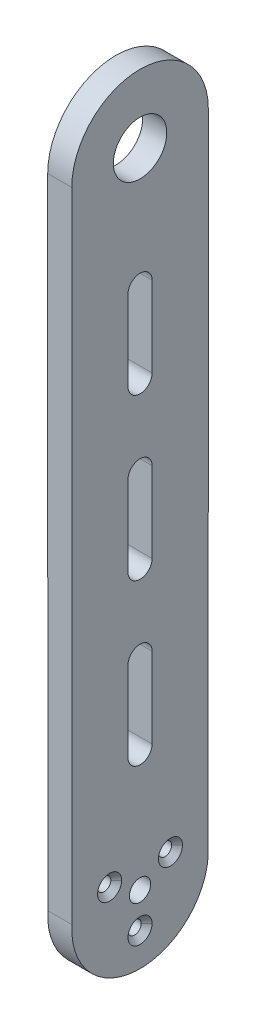
ISO-10303-21;
HEADER;
FILE_DESCRIPTION(('STEP AP214'),'2;1');
FILE_NAME('part.step','',(''),(''),'','','');
FILE_SCHEMA(('AUTOMOTIVE_DESIGN { 1 0 10303 214 1 1 1 1 }'));
ENDSEC;
DATA;
#1=APPLICATION_CONTEXT('core data for automotive mechanical design processes');
#2=APPLICATION_PROTOCOL_DEFINITION('international standard','automotive_design',2000,#1);
#3=PRODUCT_CONTEXT('',#1,'mechanical');
#4=PRODUCT('Part','Part','',(#3));
#5=PRODUCT_RELATED_PRODUCT_CATEGORY('part','',(#4));
#6=PRODUCT_DEFINITION_FORMATION('','',#4);
#7=PRODUCT_DEFINITION_CONTEXT('part definition',#1,'design');
#8=PRODUCT_DEFINITION('design','',#6,#7);
#9=PRODUCT_DEFINITION_SHAPE('','',#8);
#10=(LENGTH_UNIT() NAMED_UNIT(*) SI_UNIT(.MILLI.,.METRE.));
#11=(NAMED_UNIT(*) PLANE_ANGLE_UNIT() SI_UNIT($,.RADIAN.));
#12=(NAMED_UNIT(*) SI_UNIT($,.STERADIAN.) SOLID_ANGLE_UNIT());
#13=UNCERTAINTY_MEASURE_WITH_UNIT(LENGTH_MEASURE(1.E-05),#10,'distance_accuracy_value','');
#14=(GEOMETRIC_REPRESENTATION_CONTEXT(3) GLOBAL_UNCERTAINTY_ASSIGNED_CONTEXT((#13)) GLOBAL_UNIT_ASSIGNED_CONTEXT((#10,
#11,#12)) REPRESENTATION_CONTEXT('',''));
#15=CARTESIAN_POINT('',(0.,0.,0.));
#16=DIRECTION('',(0.,0.,1.));
#17=DIRECTION('',(1.,0.,0.));
#18=AXIS2_PLACEMENT_3D('',#15,#16,#17);
#19=CARTESIAN_POINT('',(-3.,0.,0.));
#20=DIRECTION('',(1.,0.,0.));
#21=DIRECTION('',(0.,0.,-1.));
#22=AXIS2_PLACEMENT_3D('',#19,#20,#21);
#23=CYLINDRICAL_SURFACE('',#22,17.);
#24=DIRECTION('',(1.,0.,0.));
#25=VECTOR('',#24,1.);
#26=CARTESIAN_POINT('',(-3.,0.999088073759542,16.9706164596597));
#27=LINE('',#26,#25);
#28=CARTESIAN_POINT('',(-3.,0.999088073759597,16.9706164596597));
#29=VERTEX_POINT('',#28);
#30=CARTESIAN_POINT('',(3.,0.999088073759543,16.9706164596597));
#31=VERTEX_POINT('',#30);
#32=EDGE_CURVE('E239',#29,#31,#27,.T.);
#33=ORIENTED_EDGE('',*,*,#32,.F.);
#34=CARTESIAN_POINT('',(-3.,0.,0.));
#35=DIRECTION('',(1.,0.,0.));
#36=DIRECTION('',(0.,0.561338641244818,0.827586206896552));
#37=AXIS2_PLACEMENT_3D('',#34,#35,#36);
#38=CIRCLE('',#37,17.);
#39=CARTESIAN_POINT('',(-3.,0.999088073759543,-16.9706164596597));
#40=VERTEX_POINT('',#39);
#41=EDGE_CURVE('E424',#29,#40,#38,.T.);
#42=ORIENTED_EDGE('',*,*,#41,.T.);
#43=DIRECTION('',(1.,0.,0.));
#44=VECTOR('',#43,1.);
#45=CARTESIAN_POINT('',(-3.,0.999088073759542,-16.9706164596597));
#46=LINE('',#45,#44);
#47=CARTESIAN_POINT('',(3.,0.999088073759543,-16.9706164596597));
#48=VERTEX_POINT('',#47);
#49=EDGE_CURVE('E68',#40,#48,#46,.T.);
#50=ORIENTED_EDGE('',*,*,#49,.T.);
#51=CARTESIAN_POINT('',(3.,0.,0.));
#52=DIRECTION('',(1.,0.,0.));
#53=DIRECTION('',(0.,0.561338641244818,0.827586206896552));
#54=AXIS2_PLACEMENT_3D('',#51,#52,#53);
#55=CIRCLE('',#54,17.);
#56=EDGE_CURVE('E72',#31,#48,#55,.T.);
#57=ORIENTED_EDGE('',*,*,#56,.F.);
#58=EDGE_LOOP('',(#33,#42,#50,#57));
#59=FACE_BOUND('',#58,.T.);
#60=ADVANCED_FACE('F52',(#59),#23,.T.);
#61=CARTESIAN_POINT('',(1.4159414336793,4.375,7.57772228311384));
#62=DIRECTION('',(1.,0.,0.));
#63=DIRECTION('',(0.,0.,-1.));
#64=AXIS2_PLACEMENT_3D('',#61,#62,#63);
#65=CONICAL_SURFACE('',#64,1.4159414336793,0.785398163397449);
#66=DIRECTION('',(-0.707106781186547,-4.31774598039509E-08,-0.707106781186546));
#67=VECTOR('',#66,1.);
#68=CARTESIAN_POINT('',(2.99999998662978,4.37500018318645,10.5777222697436));
#69=LINE('',#68,#67);
#70=CARTESIAN_POINT('',(2.99999999539441,4.37500005514268,10.5777222785082));
#71=VERTEX_POINT('',#70);
#72=CARTESIAN_POINT('',(1.65,4.37500010075255,9.22772228311382));
#73=VERTEX_POINT('',#72);
#74=EDGE_CURVE('E56',#71,#73,#69,.T.);
#75=ORIENTED_EDGE('',*,*,#74,.T.);
#76=CARTESIAN_POINT('',(1.65,4.375,7.57772228311384));
#77=DIRECTION('',(1.,0.,0.));
#78=DIRECTION('',(0.,0.,-1.));
#79=AXIS2_PLACEMENT_3D('',#76,#77,#78);
#80=CIRCLE('',#79,1.65);
#81=CARTESIAN_POINT('',(1.65,4.37499989924745,5.92772228311384));
#82=VERTEX_POINT('',#81);
#83=EDGE_CURVE('E408',#73,#82,#80,.F.);
#84=ORIENTED_EDGE('',*,*,#83,.T.);
#85=DIRECTION('',(-0.707106781186547,4.31774602128291E-08,0.707106781186546));
#86=VECTOR('',#85,1.);
#87=CARTESIAN_POINT('',(2.99999998662978,4.37499981681355,4.57772229648406));
#88=LINE('',#87,#86);
#89=CARTESIAN_POINT('',(2.99999999539441,4.37499994485732,4.57772228771943));
#90=VERTEX_POINT('',#89);
#91=EDGE_CURVE('E12',#90,#82,#88,.T.);
#92=ORIENTED_EDGE('',*,*,#91,.F.);
#93=CARTESIAN_POINT('',(3.,4.375,7.57772228311384));
#94=DIRECTION('',(-1.,0.,0.));
#95=DIRECTION('',(0.,0.,1.));
#96=AXIS2_PLACEMENT_3D('',#93,#94,#95);
#97=CIRCLE('',#96,3.);
#98=EDGE_CURVE('E449',#71,#90,#97,.T.);
#99=ORIENTED_EDGE('',*,*,#98,.F.);
#100=EDGE_LOOP('',(#75,#84,#92,#99));
#101=FACE_BOUND('',#100,.T.);
#102=ADVANCED_FACE('F54',(#101),#65,.F.);
#103=CARTESIAN_POINT('',(1.4159414336793,4.375,7.57772228311384));
#104=DIRECTION('',(1.,0.,0.));
#105=DIRECTION('',(0.,0.,-1.));
#106=AXIS2_PLACEMENT_3D('',#103,#104,#105);
#107=CONICAL_SURFACE('',#106,1.4159414336793,0.785398163397449);
#108=ORIENTED_EDGE('',*,*,#91,.T.);
#109=CARTESIAN_POINT('',(1.65,4.375,7.57772228311384));
#110=DIRECTION('',(1.,0.,0.));
#111=DIRECTION('',(0.,0.,-1.));
#112=AXIS2_PLACEMENT_3D('',#109,#110,#111);
#113=CIRCLE('',#112,1.65);
#114=EDGE_CURVE('E404',#82,#73,#113,.F.);
#115=ORIENTED_EDGE('',*,*,#114,.T.);
#116=ORIENTED_EDGE('',*,*,#74,.F.);
#117=CARTESIAN_POINT('',(3.,4.375,7.57772228311384));
#118=DIRECTION('',(-1.,0.,0.));
#119=DIRECTION('',(0.,0.,-1.));
#120=AXIS2_PLACEMENT_3D('',#117,#118,#119);
#121=CIRCLE('',#120,3.);
#122=EDGE_CURVE('E445',#90,#71,#121,.T.);
#123=ORIENTED_EDGE('',*,*,#122,.F.);
#124=EDGE_LOOP('',(#108,#115,#116,#123));
#125=FACE_BOUND('',#124,.T.);
#126=ADVANCED_FACE('F509',(#125),#107,.F.);
#127=CARTESIAN_POINT('',(1.4159414336793,4.375,-7.57772228311384));
#128=DIRECTION('',(1.,0.,0.));
#129=DIRECTION('',(0.,0.,-1.));
#130=AXIS2_PLACEMENT_3D('',#127,#128,#129);
#131=CONICAL_SURFACE('',#130,1.4159414336793,0.785398163397449);
#132=DIRECTION('',(-0.707106781186547,-4.31774606217073E-08,-0.707106781186546));
#133=VECTOR('',#132,1.);
#134=CARTESIAN_POINT('',(2.99999998662979,4.37500018318645,-4.57772229648406));
#135=LINE('',#134,#133);
#136=CARTESIAN_POINT('',(2.99999999539441,4.37500005514268,-4.57772228771943));
#137=VERTEX_POINT('',#136);
#138=CARTESIAN_POINT('',(1.65,4.37500010075255,-5.92772228311385));
#139=VERTEX_POINT('',#138);
#140=EDGE_CURVE('E458',#137,#139,#135,.T.);
#141=ORIENTED_EDGE('',*,*,#140,.T.);
#142=CARTESIAN_POINT('',(1.65,4.375,-7.57772228311384));
#143=DIRECTION('',(1.,0.,0.));
#144=DIRECTION('',(0.,0.,-1.));
#145=AXIS2_PLACEMENT_3D('',#142,#143,#144);
#146=CIRCLE('',#145,1.65);
#147=CARTESIAN_POINT('',(1.65,4.37499989924745,-9.22772228311382));
#148=VERTEX_POINT('',#147);
#149=EDGE_CURVE('E416',#139,#148,#146,.F.);
#150=ORIENTED_EDGE('',*,*,#149,.T.);
#151=DIRECTION('',(-0.707106781186548,4.31774598039509E-08,0.707106781186546));
#152=VECTOR('',#151,1.);
#153=CARTESIAN_POINT('',(2.99999998662978,4.37499981681355,-10.5777222697436));
#154=LINE('',#153,#152);
#155=CARTESIAN_POINT('',(2.99999999539441,4.37499994485732,-10.5777222785082));
#156=VERTEX_POINT('',#155);
#157=EDGE_CURVE('E462',#156,#148,#154,.T.);
#158=ORIENTED_EDGE('',*,*,#157,.F.);
#159=CARTESIAN_POINT('',(3.,4.375,-7.57772228311384));
#160=DIRECTION('',(-1.,0.,0.));
#161=DIRECTION('',(0.,0.,1.));
#162=AXIS2_PLACEMENT_3D('',#159,#160,#161);
#163=CIRCLE('',#162,3.);
#164=EDGE_CURVE('E441',#137,#156,#163,.T.);
#165=ORIENTED_EDGE('',*,*,#164,.F.);
#166=EDGE_LOOP('',(#141,#150,#158,#165));
#167=FACE_BOUND('',#166,.T.);
#168=ADVANCED_FACE('F470',(#167),#131,.F.);
#169=CARTESIAN_POINT('',(1.4159414336793,4.375,-7.57772228311384));
#170=DIRECTION('',(1.,0.,0.));
#171=DIRECTION('',(0.,0.,-1.));
#172=AXIS2_PLACEMENT_3D('',#169,#170,#171);
#173=CONICAL_SURFACE('',#172,1.4159414336793,0.785398163397449);
#174=ORIENTED_EDGE('',*,*,#157,.T.);
#175=CARTESIAN_POINT('',(1.65,4.375,-7.57772228311384));
#176=DIRECTION('',(1.,0.,0.));
#177=DIRECTION('',(0.,0.,-1.));
#178=AXIS2_PLACEMENT_3D('',#175,#176,#177);
#179=CIRCLE('',#178,1.65);
#180=EDGE_CURVE('E412',#148,#139,#179,.F.);
#181=ORIENTED_EDGE('',*,*,#180,.T.);
#182=ORIENTED_EDGE('',*,*,#140,.F.);
#183=CARTESIAN_POINT('',(3.,4.375,-7.57772228311384));
#184=DIRECTION('',(-1.,0.,0.));
#185=DIRECTION('',(0.,0.,-1.));
#186=AXIS2_PLACEMENT_3D('',#183,#184,#185);
#187=CIRCLE('',#186,3.);
#188=EDGE_CURVE('E437',#156,#137,#187,.T.);
#189=ORIENTED_EDGE('',*,*,#188,.F.);
#190=EDGE_LOOP('',(#174,#181,#182,#189));
#191=FACE_BOUND('',#190,.T.);
#192=ADVANCED_FACE('F473',(#191),#173,.F.);
#193=CARTESIAN_POINT('',(1.4159414336793,-8.75,0.));
#194=DIRECTION('',(1.,0.,0.));
#195=DIRECTION('',(0.,0.,-1.));
#196=AXIS2_PLACEMENT_3D('',#193,#194,#195);
#197=CONICAL_SURFACE('',#196,1.4159414336793,0.785398163397449);
#198=DIRECTION('',(-0.707106781186547,-4.31774610305856E-08,-0.707106781186546));
#199=VECTOR('',#198,1.);
#200=CARTESIAN_POINT('',(2.99999998662978,-8.74999981681355,2.99999998662978));
#201=LINE('',#200,#199);
#202=CARTESIAN_POINT('',(2.99999999539441,-8.74999994485732,2.99999999539441));
#203=VERTEX_POINT('',#202);
#204=CARTESIAN_POINT('',(1.65,-8.74999989924745,1.65));
#205=VERTEX_POINT('',#204);
#206=EDGE_CURVE('E453',#203,#205,#201,.T.);
#207=ORIENTED_EDGE('',*,*,#206,.T.);
#208=CARTESIAN_POINT('',(1.65,-8.75,0.));
#209=DIRECTION('',(1.,0.,0.));
#210=DIRECTION('',(0.,0.,-1.));
#211=AXIS2_PLACEMENT_3D('',#208,#209,#210);
#212=CIRCLE('',#211,1.65);
#213=CARTESIAN_POINT('',(1.65,-8.75000010075255,-1.65));
#214=VERTEX_POINT('',#213);
#215=EDGE_CURVE('E400',#205,#214,#212,.F.);
#216=ORIENTED_EDGE('',*,*,#215,.T.);
#217=DIRECTION('',(-0.707106781186547,4.31774585773161E-08,0.707106781186546));
#218=VECTOR('',#217,1.);
#219=CARTESIAN_POINT('',(2.99999998662978,-8.75000018318645,-2.99999998662978));
#220=LINE('',#219,#218);
#221=CARTESIAN_POINT('',(2.99999999539441,-8.75000005514268,-2.99999999539441));
#222=VERTEX_POINT('',#221);
#223=EDGE_CURVE('E454',#222,#214,#220,.T.);
#224=ORIENTED_EDGE('',*,*,#223,.F.);
#225=CARTESIAN_POINT('',(3.,-8.75,0.));
#226=DIRECTION('',(-1.,0.,0.));
#227=DIRECTION('',(0.,0.,1.));
#228=AXIS2_PLACEMENT_3D('',#225,#226,#227);
#229=CIRCLE('',#228,3.);
#230=EDGE_CURVE('E433',#203,#222,#229,.T.);
#231=ORIENTED_EDGE('',*,*,#230,.F.);
#232=EDGE_LOOP('',(#207,#216,#224,#231));
#233=FACE_BOUND('',#232,.T.);
#234=ADVANCED_FACE('F514',(#233),#197,.F.);
#235=CARTESIAN_POINT('',(1.4159414336793,-8.75,0.));
#236=DIRECTION('',(1.,0.,0.));
#237=DIRECTION('',(0.,0.,-1.));
#238=AXIS2_PLACEMENT_3D('',#235,#236,#237);
#239=CONICAL_SURFACE('',#238,1.4159414336793,0.785398163397449);
#240=ORIENTED_EDGE('',*,*,#223,.T.);
#241=CARTESIAN_POINT('',(1.65,-8.75,0.));
#242=DIRECTION('',(1.,0.,0.));
#243=DIRECTION('',(0.,0.,-1.));
#244=AXIS2_PLACEMENT_3D('',#241,#242,#243);
#245=CIRCLE('',#244,1.65);
#246=EDGE_CURVE('E396',#214,#205,#245,.F.);
#247=ORIENTED_EDGE('',*,*,#246,.T.);
#248=ORIENTED_EDGE('',*,*,#206,.F.);
#249=CARTESIAN_POINT('',(3.,-8.75,0.));
#250=DIRECTION('',(-1.,0.,0.));
#251=DIRECTION('',(0.,0.,-1.));
#252=AXIS2_PLACEMENT_3D('',#249,#250,#251);
#253=CIRCLE('',#252,3.);
#254=EDGE_CURVE('E429',#222,#203,#253,.T.);
#255=ORIENTED_EDGE('',*,*,#254,.F.);
#256=EDGE_LOOP('',(#240,#247,#248,#255));
#257=FACE_BOUND('',#256,.T.);
#258=ADVANCED_FACE('F478',(#257),#239,.F.);
#259=CARTESIAN_POINT('',(3.,0.,0.));
#260=DIRECTION('',(1.,0.,0.));
#261=DIRECTION('',(0.,0.,-1.));
#262=AXIS2_PLACEMENT_3D('',#259,#260,#261);
#263=PLANE('',#262);
#264=DIRECTION('',(0.,-0.999999982924281,-0.000184801077444281));
#265=VECTOR('',#264,1.);
#266=CARTESIAN_POINT('',(3.,-0.00313615403279145,16.9704312475394));
#267=LINE('',#266,#265);
#268=CARTESIAN_POINT('',(3.,160.,17.));
#269=VERTEX_POINT('',#268);
#270=EDGE_CURVE('E219',#269,#31,#267,.T.);
#271=ORIENTED_EDGE('',*,*,#270,.T.);
#272=ORIENTED_EDGE('',*,*,#56,.T.);
#273=DIRECTION('',(0.,-0.999999982924281,0.000184801077444281));
#274=VECTOR('',#273,1.);
#275=CARTESIAN_POINT('',(3.,-0.00313615403279145,-16.9704312475394));
#276=LINE('',#275,#274);
#277=CARTESIAN_POINT('',(3.,160.,-17.));
#278=VERTEX_POINT('',#277);
#279=EDGE_CURVE('E231',#278,#48,#276,.T.);
#280=ORIENTED_EDGE('',*,*,#279,.F.);
#281=CARTESIAN_POINT('',(3.,160.,0.));
#282=DIRECTION('',(1.,0.,0.));
#283=DIRECTION('',(0.,0.,-1.));
#284=AXIS2_PLACEMENT_3D('',#281,#282,#283);
#285=CIRCLE('',#284,17.);
#286=EDGE_CURVE('E206',#278,#269,#285,.T.);
#287=ORIENTED_EDGE('',*,*,#286,.T.);
#288=EDGE_LOOP('',(#271,#272,#280,#287));
#289=FACE_BOUND('',#288,.T.);
#290=CARTESIAN_POINT('',(3.,30.,0.));
#291=DIRECTION('',(1.,0.,0.));
#292=DIRECTION('',(0.,0.,-1.));
#293=AXIS2_PLACEMENT_3D('',#290,#291,#292);
#294=CIRCLE('',#293,3.);
#295=CARTESIAN_POINT('',(3.,30.,3.00000000000001));
#296=VERTEX_POINT('',#295);
#297=CARTESIAN_POINT('',(3.,30.,-2.99999999999999));
#298=VERTEX_POINT('',#297);
#299=EDGE_CURVE('E369',#296,#298,#294,.T.);
#300=ORIENTED_EDGE('',*,*,#299,.F.);
#301=DIRECTION('',(0.,-1.,0.));
#302=VECTOR('',#301,1.);
#303=CARTESIAN_POINT('',(3.,0.,3.00000000000001));
#304=LINE('',#303,#302);
#305=CARTESIAN_POINT('',(3.,50.,3.00000000000001));
#306=VERTEX_POINT('',#305);
#307=EDGE_CURVE('E358',#306,#296,#304,.T.);
#308=ORIENTED_EDGE('',*,*,#307,.F.);
#309=CARTESIAN_POINT('',(3.,50.,0.));
#310=DIRECTION('',(1.,0.,0.));
#311=DIRECTION('',(0.,0.,-1.));
#312=AXIS2_PLACEMENT_3D('',#309,#310,#311);
#313=CIRCLE('',#312,3.);
#314=CARTESIAN_POINT('',(3.,50.,-2.99999999999999));
#315=VERTEX_POINT('',#314);
#316=EDGE_CURVE('E361',#315,#306,#313,.T.);
#317=ORIENTED_EDGE('',*,*,#316,.F.);
#318=DIRECTION('',(0.,-1.,0.));
#319=VECTOR('',#318,1.);
#320=CARTESIAN_POINT('',(3.,0.,-2.99999999999999));
#321=LINE('',#320,#319);
#322=EDGE_CURVE('E365',#315,#298,#321,.T.);
#323=ORIENTED_EDGE('',*,*,#322,.T.);
#324=EDGE_LOOP('',(#300,#308,#317,#323));
#325=FACE_BOUND('',#324,.T.);
#326=CARTESIAN_POINT('',(3.,110.,0.));
#327=DIRECTION('',(1.,0.,0.));
#328=DIRECTION('',(0.,0.,-1.));
#329=AXIS2_PLACEMENT_3D('',#326,#327,#328);
#330=CIRCLE('',#329,3.);
#331=CARTESIAN_POINT('',(3.,110.,3.));
#332=VERTEX_POINT('',#331);
#333=CARTESIAN_POINT('',(3.,110.,-3.));
#334=VERTEX_POINT('',#333);
#335=EDGE_CURVE('E355',#332,#334,#330,.T.);
#336=ORIENTED_EDGE('',*,*,#335,.F.);
#337=DIRECTION('',(0.,-1.,0.));
#338=VECTOR('',#337,1.);
#339=CARTESIAN_POINT('',(3.,0.,3.));
#340=LINE('',#339,#338);
#341=CARTESIAN_POINT('',(3.,130.,3.));
#342=VERTEX_POINT('',#341);
#343=EDGE_CURVE('E344',#342,#332,#340,.T.);
#344=ORIENTED_EDGE('',*,*,#343,.F.);
#345=CARTESIAN_POINT('',(3.,130.,0.));
#346=DIRECTION('',(1.,0.,0.));
#347=DIRECTION('',(0.,0.,-1.));
#348=AXIS2_PLACEMENT_3D('',#345,#346,#347);
#349=CIRCLE('',#348,3.);
#350=CARTESIAN_POINT('',(3.,130.,-3.));
#351=VERTEX_POINT('',#350);
#352=EDGE_CURVE('E347',#351,#342,#349,.T.);
#353=ORIENTED_EDGE('',*,*,#352,.F.);
#354=DIRECTION('',(0.,-1.,0.));
#355=VECTOR('',#354,1.);
#356=CARTESIAN_POINT('',(3.,0.,-3.));
#357=LINE('',#356,#355);
#358=EDGE_CURVE('E351',#351,#334,#357,.T.);
#359=ORIENTED_EDGE('',*,*,#358,.T.);
#360=EDGE_LOOP('',(#336,#344,#353,#359));
#361=FACE_BOUND('',#360,.T.);
#362=CARTESIAN_POINT('',(3.,70.,0.));
#363=DIRECTION('',(1.,0.,0.));
#364=DIRECTION('',(0.,0.,-1.));
#365=AXIS2_PLACEMENT_3D('',#362,#363,#364);
#366=CIRCLE('',#365,3.);
#367=CARTESIAN_POINT('',(3.,70.,3.00000000000001));
#368=VERTEX_POINT('',#367);
#369=CARTESIAN_POINT('',(3.,70.,-2.99999999999999));
#370=VERTEX_POINT('',#369);
#371=EDGE_CURVE('E341',#368,#370,#366,.T.);
#372=ORIENTED_EDGE('',*,*,#371,.F.);
#373=DIRECTION('',(0.,-1.,0.));
#374=VECTOR('',#373,1.);
#375=CARTESIAN_POINT('',(3.,0.,3.00000000000001));
#376=LINE('',#375,#374);
#377=CARTESIAN_POINT('',(3.,90.,3.00000000000001));
#378=VERTEX_POINT('',#377);
#379=EDGE_CURVE('E321',#378,#368,#376,.T.);
#380=ORIENTED_EDGE('',*,*,#379,.F.);
#381=CARTESIAN_POINT('',(3.,90.,0.));
#382=DIRECTION('',(1.,0.,0.));
#383=DIRECTION('',(0.,0.,-1.));
#384=AXIS2_PLACEMENT_3D('',#381,#382,#383);
#385=CIRCLE('',#384,3.);
#386=CARTESIAN_POINT('',(3.,90.,-2.99999999999999));
#387=VERTEX_POINT('',#386);
#388=EDGE_CURVE('E333',#387,#378,#385,.T.);
#389=ORIENTED_EDGE('',*,*,#388,.F.);
#390=DIRECTION('',(0.,-1.,0.));
#391=VECTOR('',#390,1.);
#392=CARTESIAN_POINT('',(3.,0.,-2.99999999999999));
#393=LINE('',#392,#391);
#394=EDGE_CURVE('E337',#387,#370,#393,.T.);
#395=ORIENTED_EDGE('',*,*,#394,.T.);
#396=EDGE_LOOP('',(#372,#380,#389,#395));
#397=FACE_BOUND('',#396,.T.);
#398=ORIENTED_EDGE('',*,*,#230,.T.);
#399=ORIENTED_EDGE('',*,*,#254,.T.);
#400=EDGE_LOOP('',(#398,#399));
#401=FACE_BOUND('',#400,.T.);
#402=ORIENTED_EDGE('',*,*,#164,.T.);
#403=ORIENTED_EDGE('',*,*,#188,.T.);
#404=EDGE_LOOP('',(#402,#403));
#405=FACE_BOUND('',#404,.T.);
#406=ORIENTED_EDGE('',*,*,#98,.T.);
#407=ORIENTED_EDGE('',*,*,#122,.T.);
#408=EDGE_LOOP('',(#406,#407));
#409=FACE_BOUND('',#408,.T.);
#410=CARTESIAN_POINT('',(3.,0.,0.));
#411=DIRECTION('',(1.,0.,0.));
#412=DIRECTION('',(0.,0.,-1.));
#413=AXIS2_PLACEMENT_3D('',#410,#411,#412);
#414=CIRCLE('',#413,2.65);
#415=CARTESIAN_POINT('',(3.,0.,-2.65));
#416=VERTEX_POINT('',#415);
#417=EDGE_CURVE('E377',#416,#416,#414,.T.);
#418=ORIENTED_EDGE('',*,*,#417,.F.);
#419=EDGE_LOOP('',(#418));
#420=FACE_BOUND('',#419,.T.);
#421=CARTESIAN_POINT('',(3.,160.,0.));
#422=DIRECTION('',(1.,0.,0.));
#423=DIRECTION('',(0.,0.,-1.));
#424=AXIS2_PLACEMENT_3D('',#421,#422,#423);
#425=CIRCLE('',#424,6.65);
#426=CARTESIAN_POINT('',(3.,160.,-6.65));
#427=VERTEX_POINT('',#426);
#428=EDGE_CURVE('E420',#427,#427,#425,.T.);
#429=ORIENTED_EDGE('',*,*,#428,.F.);
#430=EDGE_LOOP('',(#429));
#431=FACE_BOUND('',#430,.T.);
#432=ADVANCED_FACE('F475',(#289,#325,#361,#397,#401,#405,#409,#420,#431),#263,.T.);
#433=CARTESIAN_POINT('',(-3.,0.,0.));
#434=DIRECTION('',(1.,0.,0.));
#435=DIRECTION('',(0.,0.,-1.));
#436=AXIS2_PLACEMENT_3D('',#433,#434,#435);
#437=PLANE('',#436);
#438=ORIENTED_EDGE('',*,*,#41,.F.);
#439=DIRECTION('',(0.,-0.999999982924281,-0.000184801077444281));
#440=VECTOR('',#439,1.);
#441=CARTESIAN_POINT('',(-3.,-0.00313615403279145,16.9704312475394));
#442=LINE('',#441,#440);
#443=CARTESIAN_POINT('',(-3.,160.,17.));
#444=VERTEX_POINT('',#443);
#445=EDGE_CURVE('E225',#444,#29,#442,.T.);
#446=ORIENTED_EDGE('',*,*,#445,.F.);
#447=CARTESIAN_POINT('',(-3.,160.,0.));
#448=DIRECTION('',(1.,0.,0.));
#449=DIRECTION('',(0.,0.,-1.));
#450=AXIS2_PLACEMENT_3D('',#447,#448,#449);
#451=CIRCLE('',#450,17.);
#452=CARTESIAN_POINT('',(-3.,160.,-17.));
#453=VERTEX_POINT('',#452);
#454=EDGE_CURVE('E204',#453,#444,#451,.T.);
#455=ORIENTED_EDGE('',*,*,#454,.F.);
#456=DIRECTION('',(0.,-0.999999982924281,0.000184801077444281));
#457=VECTOR('',#456,1.);
#458=CARTESIAN_POINT('',(-3.,-0.00313615403279145,-16.9704312475394));
#459=LINE('',#458,#457);
#460=EDGE_CURVE('E214',#453,#40,#459,.T.);
#461=ORIENTED_EDGE('',*,*,#460,.T.);
#462=EDGE_LOOP('',(#438,#446,#455,#461));
#463=FACE_BOUND('',#462,.T.);
#464=DIRECTION('',(0.,1.,0.));
#465=VECTOR('',#464,1.);
#466=CARTESIAN_POINT('',(-3.,30.,3.00000000000001));
#467=LINE('',#466,#465);
#468=CARTESIAN_POINT('',(-3.,30.,3.00000000000001));
#469=VERTEX_POINT('',#468);
#470=CARTESIAN_POINT('',(-3.,50.,3.00000000000001));
#471=VERTEX_POINT('',#470);
#472=EDGE_CURVE('E297',#469,#471,#467,.T.);
#473=ORIENTED_EDGE('',*,*,#472,.F.);
#474=CARTESIAN_POINT('',(-3.,30.,0.));
#475=DIRECTION('',(-1.,0.,0.));
#476=DIRECTION('',(0.,0.,1.));
#477=AXIS2_PLACEMENT_3D('',#474,#475,#476);
#478=CIRCLE('',#477,3.);
#479=CARTESIAN_POINT('',(-3.,30.,-2.99999999999999));
#480=VERTEX_POINT('',#479);
#481=EDGE_CURVE('E261',#480,#469,#478,.T.);
#482=ORIENTED_EDGE('',*,*,#481,.F.);
#483=DIRECTION('',(0.,1.,0.));
#484=VECTOR('',#483,1.);
#485=CARTESIAN_POINT('',(-3.,30.,-2.99999999999999));
#486=LINE('',#485,#484);
#487=CARTESIAN_POINT('',(-3.,50.,-2.99999999999999));
#488=VERTEX_POINT('',#487);
#489=EDGE_CURVE('E281',#480,#488,#486,.T.);
#490=ORIENTED_EDGE('',*,*,#489,.T.);
#491=CARTESIAN_POINT('',(-3.,50.,0.));
#492=DIRECTION('',(-1.,0.,0.));
#493=DIRECTION('',(0.,0.,1.));
#494=AXIS2_PLACEMENT_3D('',#491,#492,#493);
#495=CIRCLE('',#494,3.);
#496=EDGE_CURVE('E293',#471,#488,#495,.T.);
#497=ORIENTED_EDGE('',*,*,#496,.F.);
#498=EDGE_LOOP('',(#473,#482,#490,#497));
#499=FACE_BOUND('',#498,.T.);
#500=DIRECTION('',(0.,1.,0.));
#501=VECTOR('',#500,1.);
#502=CARTESIAN_POINT('',(-3.,110.,3.));
#503=LINE('',#502,#501);
#504=CARTESIAN_POINT('',(-3.,110.,3.));
#505=VERTEX_POINT('',#504);
#506=CARTESIAN_POINT('',(-3.,130.,3.));
#507=VERTEX_POINT('',#506);
#508=EDGE_CURVE('E269',#505,#507,#503,.T.);
#509=ORIENTED_EDGE('',*,*,#508,.F.);
#510=CARTESIAN_POINT('',(-3.,110.,0.));
#511=DIRECTION('',(-1.,0.,0.));
#512=DIRECTION('',(0.,0.,1.));
#513=AXIS2_PLACEMENT_3D('',#510,#511,#512);
#514=CIRCLE('',#513,3.);
#515=CARTESIAN_POINT('',(-3.,110.,-3.));
#516=VERTEX_POINT('',#515);
#517=EDGE_CURVE('E273',#516,#505,#514,.T.);
#518=ORIENTED_EDGE('',*,*,#517,.F.);
#519=DIRECTION('',(0.,1.,0.));
#520=VECTOR('',#519,1.);
#521=CARTESIAN_POINT('',(-3.,110.,-3.));
#522=LINE('',#521,#520);
#523=CARTESIAN_POINT('',(-3.,130.,-3.));
#524=VERTEX_POINT('',#523);
#525=EDGE_CURVE('E251',#516,#524,#522,.T.);
#526=ORIENTED_EDGE('',*,*,#525,.T.);
#527=CARTESIAN_POINT('',(-3.,130.,0.));
#528=DIRECTION('',(-1.,0.,0.));
#529=DIRECTION('',(0.,0.,1.));
#530=AXIS2_PLACEMENT_3D('',#527,#528,#529);
#531=CIRCLE('',#530,3.);
#532=EDGE_CURVE('E265',#507,#524,#531,.T.);
#533=ORIENTED_EDGE('',*,*,#532,.F.);
#534=EDGE_LOOP('',(#509,#518,#526,#533));
#535=FACE_BOUND('',#534,.T.);
#536=DIRECTION('',(0.,1.,0.));
#537=VECTOR('',#536,1.);
#538=CARTESIAN_POINT('',(-3.,70.,3.00000000000001));
#539=LINE('',#538,#537);
#540=CARTESIAN_POINT('',(-3.,70.,3.00000000000001));
#541=VERTEX_POINT('',#540);
#542=CARTESIAN_POINT('',(-3.,90.,3.00000000000001));
#543=VERTEX_POINT('',#542);
#544=EDGE_CURVE('E305',#541,#543,#539,.T.);
#545=ORIENTED_EDGE('',*,*,#544,.F.);
#546=CARTESIAN_POINT('',(-3.,70.,0.));
#547=DIRECTION('',(-1.,0.,0.));
#548=DIRECTION('',(0.,0.,1.));
#549=AXIS2_PLACEMENT_3D('',#546,#547,#548);
#550=CIRCLE('',#549,3.);
#551=CARTESIAN_POINT('',(-3.,70.,-2.99999999999999));
#552=VERTEX_POINT('',#551);
#553=EDGE_CURVE('E276',#552,#541,#550,.T.);
#554=ORIENTED_EDGE('',*,*,#553,.F.);
#555=DIRECTION('',(0.,1.,0.));
#556=VECTOR('',#555,1.);
#557=CARTESIAN_POINT('',(-3.,70.,-2.99999999999999));
#558=LINE('',#557,#556);
#559=CARTESIAN_POINT('',(-3.,90.,-2.99999999999999));
#560=VERTEX_POINT('',#559);
#561=EDGE_CURVE('E313',#552,#560,#558,.T.);
#562=ORIENTED_EDGE('',*,*,#561,.T.);
#563=CARTESIAN_POINT('',(-3.,90.,0.));
#564=DIRECTION('',(-1.,0.,0.));
#565=DIRECTION('',(0.,0.,1.));
#566=AXIS2_PLACEMENT_3D('',#563,#564,#565);
#567=CIRCLE('',#566,3.);
#568=EDGE_CURVE('E309',#543,#560,#567,.T.);
#569=ORIENTED_EDGE('',*,*,#568,.F.);
#570=EDGE_LOOP('',(#545,#554,#562,#569));
#571=FACE_BOUND('',#570,.T.);
#572=CARTESIAN_POINT('',(-3.,0.,0.));
#573=DIRECTION('',(-1.,0.,0.));
#574=DIRECTION('',(0.,0.,1.));
#575=AXIS2_PLACEMENT_3D('',#572,#573,#574);
#576=CIRCLE('',#575,2.65);
#577=CARTESIAN_POINT('',(-3.,0.,2.65));
#578=VERTEX_POINT('',#577);
#579=EDGE_CURVE('E372',#578,#578,#576,.T.);
#580=ORIENTED_EDGE('',*,*,#579,.F.);
#581=EDGE_LOOP('',(#580));
#582=FACE_BOUND('',#581,.T.);
#583=CARTESIAN_POINT('',(-3.,-8.75,0.));
#584=DIRECTION('',(-1.,0.,0.));
#585=DIRECTION('',(0.,0.,1.));
#586=AXIS2_PLACEMENT_3D('',#583,#584,#585);
#587=CIRCLE('',#586,1.65);
#588=CARTESIAN_POINT('',(-3.,-8.75,1.65));
#589=VERTEX_POINT('',#588);
#590=EDGE_CURVE('E386',#589,#589,#587,.T.);
#591=ORIENTED_EDGE('',*,*,#590,.F.);
#592=EDGE_LOOP('',(#591));
#593=FACE_BOUND('',#592,.T.);
#594=CARTESIAN_POINT('',(-3.,4.375,7.57772228311384));
#595=DIRECTION('',(-1.,0.,0.));
#596=DIRECTION('',(0.,0.,1.));
#597=AXIS2_PLACEMENT_3D('',#594,#595,#596);
#598=CIRCLE('',#597,1.65);
#599=CARTESIAN_POINT('',(-3.,4.375,9.22772228311384));
#600=VERTEX_POINT('',#599);
#601=EDGE_CURVE('E382',#600,#600,#598,.T.);
#602=ORIENTED_EDGE('',*,*,#601,.F.);
#603=EDGE_LOOP('',(#602));
#604=FACE_BOUND('',#603,.T.);
#605=CARTESIAN_POINT('',(-3.,4.375,-7.57772228311384));
#606=DIRECTION('',(-1.,0.,0.));
#607=DIRECTION('',(0.,0.,1.));
#608=AXIS2_PLACEMENT_3D('',#605,#606,#607);
#609=CIRCLE('',#608,1.65);
#610=CARTESIAN_POINT('',(-3.,4.375,-5.92772228311384));
#611=VERTEX_POINT('',#610);
#612=EDGE_CURVE('E378',#611,#611,#609,.T.);
#613=ORIENTED_EDGE('',*,*,#612,.F.);
#614=EDGE_LOOP('',(#613));
#615=FACE_BOUND('',#614,.T.);
#616=CARTESIAN_POINT('',(-3.,160.,0.));
#617=DIRECTION('',(-1.,0.,0.));
#618=DIRECTION('',(0.,0.,1.));
#619=AXIS2_PLACEMENT_3D('',#616,#617,#618);
#620=CIRCLE('',#619,6.65);
#621=CARTESIAN_POINT('',(-3.,160.,6.65));
#622=VERTEX_POINT('',#621);
#623=EDGE_CURVE('E373',#622,#622,#620,.T.);
#624=ORIENTED_EDGE('',*,*,#623,.F.);
#625=EDGE_LOOP('',(#624));
#626=FACE_BOUND('',#625,.T.);
#627=ADVANCED_FACE('F222',(#463,#499,#535,#571,#582,#593,#604,#615,#626),#437,.F.);
#628=CARTESIAN_POINT('',(7.,0.,0.));
#629=DIRECTION('',(-1.,0.,0.));
#630=DIRECTION('',(0.,0.,1.));
#631=AXIS2_PLACEMENT_3D('',#628,#629,#630);
#632=CYLINDRICAL_SURFACE('',#631,2.65);
#633=ORIENTED_EDGE('',*,*,#417,.T.);
#634=EDGE_LOOP('',(#633));
#635=FACE_BOUND('',#634,.T.);
#636=ORIENTED_EDGE('',*,*,#579,.T.);
#637=EDGE_LOOP('',(#636));
#638=FACE_BOUND('',#637,.T.);
#639=ADVANCED_FACE('F495',(#635,#638),#632,.F.);
#640=CARTESIAN_POINT('',(7.,-8.75,0.));
#641=DIRECTION('',(-1.,0.,0.));
#642=DIRECTION('',(0.,0.,1.));
#643=AXIS2_PLACEMENT_3D('',#640,#641,#642);
#644=CYLINDRICAL_SURFACE('',#643,1.65);
#645=ORIENTED_EDGE('',*,*,#590,.T.);
#646=EDGE_LOOP('',(#645));
#647=FACE_BOUND('',#646,.T.);
#648=ORIENTED_EDGE('',*,*,#246,.F.);
#649=ORIENTED_EDGE('',*,*,#215,.F.);
#650=EDGE_LOOP('',(#648,#649));
#651=FACE_BOUND('',#650,.T.);
#652=ADVANCED_FACE('F500',(#647,#651),#644,.F.);
#653=CARTESIAN_POINT('',(7.,4.375,7.57772228311384));
#654=DIRECTION('',(-1.,0.,0.));
#655=DIRECTION('',(0.,0.,1.));
#656=AXIS2_PLACEMENT_3D('',#653,#654,#655);
#657=CYLINDRICAL_SURFACE('',#656,1.65);
#658=ORIENTED_EDGE('',*,*,#601,.T.);
#659=EDGE_LOOP('',(#658));
#660=FACE_BOUND('',#659,.T.);
#661=ORIENTED_EDGE('',*,*,#114,.F.);
#662=ORIENTED_EDGE('',*,*,#83,.F.);
#663=EDGE_LOOP('',(#661,#662));
#664=FACE_BOUND('',#663,.T.);
#665=ADVANCED_FACE('F530',(#660,#664),#657,.F.);
#666=CARTESIAN_POINT('',(7.,4.375,-7.57772228311384));
#667=DIRECTION('',(-1.,0.,0.));
#668=DIRECTION('',(0.,0.,1.));
#669=AXIS2_PLACEMENT_3D('',#666,#667,#668);
#670=CYLINDRICAL_SURFACE('',#669,1.65);
#671=ORIENTED_EDGE('',*,*,#612,.T.);
#672=EDGE_LOOP('',(#671));
#673=FACE_BOUND('',#672,.T.);
#674=ORIENTED_EDGE('',*,*,#180,.F.);
#675=ORIENTED_EDGE('',*,*,#149,.F.);
#676=EDGE_LOOP('',(#674,#675));
#677=FACE_BOUND('',#676,.T.);
#678=ADVANCED_FACE('F490',(#673,#677),#670,.F.);
#679=CARTESIAN_POINT('',(7.,160.,0.));
#680=DIRECTION('',(-1.,0.,0.));
#681=DIRECTION('',(0.,0.,1.));
#682=AXIS2_PLACEMENT_3D('',#679,#680,#681);
#683=CYLINDRICAL_SURFACE('',#682,6.65);
#684=ORIENTED_EDGE('',*,*,#428,.T.);
#685=EDGE_LOOP('',(#684));
#686=FACE_BOUND('',#685,.T.);
#687=ORIENTED_EDGE('',*,*,#623,.T.);
#688=EDGE_LOOP('',(#687));
#689=FACE_BOUND('',#688,.T.);
#690=ADVANCED_FACE('F486',(#686,#689),#683,.F.);
#691=CARTESIAN_POINT('',(13.,70.,0.));
#692=DIRECTION('',(-1.,0.,0.));
#693=DIRECTION('',(0.,0.,1.));
#694=AXIS2_PLACEMENT_3D('',#691,#692,#693);
#695=CYLINDRICAL_SURFACE('',#694,3.);
#696=ORIENTED_EDGE('',*,*,#371,.T.);
#697=DIRECTION('',(-1.,0.,0.));
#698=VECTOR('',#697,1.);
#699=CARTESIAN_POINT('',(13.,70.,-2.99999999999999));
#700=LINE('',#699,#698);
#701=EDGE_CURVE('E318',#370,#552,#700,.T.);
#702=ORIENTED_EDGE('',*,*,#701,.T.);
#703=ORIENTED_EDGE('',*,*,#553,.T.);
#704=DIRECTION('',(-1.,0.,0.));
#705=VECTOR('',#704,1.);
#706=CARTESIAN_POINT('',(13.,70.,3.00000000000001));
#707=LINE('',#706,#705);
#708=EDGE_CURVE('E317',#368,#541,#707,.T.);
#709=ORIENTED_EDGE('',*,*,#708,.F.);
#710=EDGE_LOOP('',(#696,#702,#703,#709));
#711=FACE_BOUND('',#710,.T.);
#712=ADVANCED_FACE('F489',(#711),#695,.F.);
#713=CARTESIAN_POINT('',(13.,70.,-2.99999999999999));
#714=DIRECTION('',(0.,0.,1.));
#715=DIRECTION('',(1.,0.,0.));
#716=AXIS2_PLACEMENT_3D('',#713,#714,#715);
#717=PLANE('',#716);
#718=DIRECTION('',(-1.,0.,0.));
#719=VECTOR('',#718,1.);
#720=CARTESIAN_POINT('',(13.,90.,-2.99999999999999));
#721=LINE('',#720,#719);
#722=EDGE_CURVE('E322',#387,#560,#721,.T.);
#723=ORIENTED_EDGE('',*,*,#722,.T.);
#724=ORIENTED_EDGE('',*,*,#561,.F.);
#725=ORIENTED_EDGE('',*,*,#701,.F.);
#726=ORIENTED_EDGE('',*,*,#394,.F.);
#727=EDGE_LOOP('',(#723,#724,#725,#726));
#728=FACE_BOUND('',#727,.T.);
#729=ADVANCED_FACE('F545',(#728),#717,.T.);
#730=CARTESIAN_POINT('',(13.,90.,0.));
#731=DIRECTION('',(-1.,0.,0.));
#732=DIRECTION('',(0.,0.,1.));
#733=AXIS2_PLACEMENT_3D('',#730,#731,#732);
#734=CYLINDRICAL_SURFACE('',#733,3.);
#735=ORIENTED_EDGE('',*,*,#388,.T.);
#736=DIRECTION('',(-1.,0.,0.));
#737=VECTOR('',#736,1.);
#738=CARTESIAN_POINT('',(13.,90.,3.00000000000001));
#739=LINE('',#738,#737);
#740=EDGE_CURVE('E325',#378,#543,#739,.T.);
#741=ORIENTED_EDGE('',*,*,#740,.T.);
#742=ORIENTED_EDGE('',*,*,#568,.T.);
#743=ORIENTED_EDGE('',*,*,#722,.F.);
#744=EDGE_LOOP('',(#735,#741,#742,#743));
#745=FACE_BOUND('',#744,.T.);
#746=ADVANCED_FACE('F551',(#745),#734,.F.);
#747=CARTESIAN_POINT('',(13.,70.,3.00000000000001));
#748=DIRECTION('',(0.,0.,1.));
#749=DIRECTION('',(1.,0.,0.));
#750=AXIS2_PLACEMENT_3D('',#747,#748,#749);
#751=PLANE('',#750);
#752=ORIENTED_EDGE('',*,*,#379,.T.);
#753=ORIENTED_EDGE('',*,*,#708,.T.);
#754=ORIENTED_EDGE('',*,*,#544,.T.);
#755=ORIENTED_EDGE('',*,*,#740,.F.);
#756=EDGE_LOOP('',(#752,#753,#754,#755));
#757=FACE_BOUND('',#756,.T.);
#758=ADVANCED_FACE('F547',(#757),#751,.F.);
#759=CARTESIAN_POINT('',(13.,110.,0.));
#760=DIRECTION('',(-1.,0.,0.));
#761=DIRECTION('',(0.,0.,1.));
#762=AXIS2_PLACEMENT_3D('',#759,#760,#761);
#763=CYLINDRICAL_SURFACE('',#762,3.);
#764=ORIENTED_EDGE('',*,*,#335,.T.);
#765=DIRECTION('',(-1.,0.,0.));
#766=VECTOR('',#765,1.);
#767=CARTESIAN_POINT('',(13.,110.,-3.));
#768=LINE('',#767,#766);
#769=EDGE_CURVE('E258',#334,#516,#768,.T.);
#770=ORIENTED_EDGE('',*,*,#769,.T.);
#771=ORIENTED_EDGE('',*,*,#517,.T.);
#772=DIRECTION('',(-1.,0.,0.));
#773=VECTOR('',#772,1.);
#774=CARTESIAN_POINT('',(13.,110.,3.));
#775=LINE('',#774,#773);
#776=EDGE_CURVE('E247',#332,#505,#775,.T.);
#777=ORIENTED_EDGE('',*,*,#776,.F.);
#778=EDGE_LOOP('',(#764,#770,#771,#777));
#779=FACE_BOUND('',#778,.T.);
#780=ADVANCED_FACE('F550',(#779),#763,.F.);
#781=CARTESIAN_POINT('',(13.,110.,-3.));
#782=DIRECTION('',(0.,0.,1.));
#783=DIRECTION('',(1.,0.,0.));
#784=AXIS2_PLACEMENT_3D('',#781,#782,#783);
#785=PLANE('',#784);
#786=DIRECTION('',(-1.,0.,0.));
#787=VECTOR('',#786,1.);
#788=CARTESIAN_POINT('',(13.,130.,-3.));
#789=LINE('',#788,#787);
#790=EDGE_CURVE('E255',#351,#524,#789,.T.);
#791=ORIENTED_EDGE('',*,*,#790,.T.);
#792=ORIENTED_EDGE('',*,*,#525,.F.);
#793=ORIENTED_EDGE('',*,*,#769,.F.);
#794=ORIENTED_EDGE('',*,*,#358,.F.);
#795=EDGE_LOOP('',(#791,#792,#793,#794));
#796=FACE_BOUND('',#795,.T.);
#797=ADVANCED_FACE('F577',(#796),#785,.T.);
#798=CARTESIAN_POINT('',(13.,130.,0.));
#799=DIRECTION('',(-1.,0.,0.));
#800=DIRECTION('',(0.,0.,1.));
#801=AXIS2_PLACEMENT_3D('',#798,#799,#800);
#802=CYLINDRICAL_SURFACE('',#801,3.);
#803=ORIENTED_EDGE('',*,*,#352,.T.);
#804=DIRECTION('',(-1.,0.,0.));
#805=VECTOR('',#804,1.);
#806=CARTESIAN_POINT('',(13.,130.,3.));
#807=LINE('',#806,#805);
#808=EDGE_CURVE('E252',#342,#507,#807,.T.);
#809=ORIENTED_EDGE('',*,*,#808,.T.);
#810=ORIENTED_EDGE('',*,*,#532,.T.);
#811=ORIENTED_EDGE('',*,*,#790,.F.);
#812=EDGE_LOOP('',(#803,#809,#810,#811));
#813=FACE_BOUND('',#812,.T.);
#814=ADVANCED_FACE('F580',(#813),#802,.F.);
#815=CARTESIAN_POINT('',(13.,110.,3.));
#816=DIRECTION('',(0.,0.,1.));
#817=DIRECTION('',(1.,0.,0.));
#818=AXIS2_PLACEMENT_3D('',#815,#816,#817);
#819=PLANE('',#818);
#820=ORIENTED_EDGE('',*,*,#343,.T.);
#821=ORIENTED_EDGE('',*,*,#776,.T.);
#822=ORIENTED_EDGE('',*,*,#508,.T.);
#823=ORIENTED_EDGE('',*,*,#808,.F.);
#824=EDGE_LOOP('',(#820,#821,#822,#823));
#825=FACE_BOUND('',#824,.T.);
#826=ADVANCED_FACE('F575',(#825),#819,.F.);
#827=CARTESIAN_POINT('',(13.,30.,0.));
#828=DIRECTION('',(-1.,0.,0.));
#829=DIRECTION('',(0.,0.,1.));
#830=AXIS2_PLACEMENT_3D('',#827,#828,#829);
#831=CYLINDRICAL_SURFACE('',#830,3.);
#832=ORIENTED_EDGE('',*,*,#299,.T.);
#833=DIRECTION('',(-1.,0.,0.));
#834=VECTOR('',#833,1.);
#835=CARTESIAN_POINT('',(13.,30.,-2.99999999999999));
#836=LINE('',#835,#834);
#837=EDGE_CURVE('E242',#298,#480,#836,.T.);
#838=ORIENTED_EDGE('',*,*,#837,.T.);
#839=ORIENTED_EDGE('',*,*,#481,.T.);
#840=DIRECTION('',(-1.,0.,0.));
#841=VECTOR('',#840,1.);
#842=CARTESIAN_POINT('',(13.,30.,3.00000000000001));
#843=LINE('',#842,#841);
#844=EDGE_CURVE('E277',#296,#469,#843,.T.);
#845=ORIENTED_EDGE('',*,*,#844,.F.);
#846=EDGE_LOOP('',(#832,#838,#839,#845));
#847=FACE_BOUND('',#846,.T.);
#848=ADVANCED_FACE('F563',(#847),#831,.F.);
#849=CARTESIAN_POINT('',(13.,30.,-2.99999999999999));
#850=DIRECTION('',(0.,0.,1.));
#851=DIRECTION('',(1.,0.,0.));
#852=AXIS2_PLACEMENT_3D('',#849,#850,#851);
#853=PLANE('',#852);
#854=DIRECTION('',(-1.,0.,0.));
#855=VECTOR('',#854,1.);
#856=CARTESIAN_POINT('',(13.,50.,-2.99999999999999));
#857=LINE('',#856,#855);
#858=EDGE_CURVE('E285',#315,#488,#857,.T.);
#859=ORIENTED_EDGE('',*,*,#858,.T.);
#860=ORIENTED_EDGE('',*,*,#489,.F.);
#861=ORIENTED_EDGE('',*,*,#837,.F.);
#862=ORIENTED_EDGE('',*,*,#322,.F.);
#863=EDGE_LOOP('',(#859,#860,#861,#862));
#864=FACE_BOUND('',#863,.T.);
#865=ADVANCED_FACE('F559',(#864),#853,.T.);
#866=CARTESIAN_POINT('',(13.,50.,0.));
#867=DIRECTION('',(-1.,0.,0.));
#868=DIRECTION('',(0.,0.,1.));
#869=AXIS2_PLACEMENT_3D('',#866,#867,#868);
#870=CYLINDRICAL_SURFACE('',#869,3.);
#871=ORIENTED_EDGE('',*,*,#316,.T.);
#872=DIRECTION('',(-1.,0.,0.));
#873=VECTOR('',#872,1.);
#874=CARTESIAN_POINT('',(13.,50.,3.00000000000001));
#875=LINE('',#874,#873);
#876=EDGE_CURVE('E282',#306,#471,#875,.T.);
#877=ORIENTED_EDGE('',*,*,#876,.T.);
#878=ORIENTED_EDGE('',*,*,#496,.T.);
#879=ORIENTED_EDGE('',*,*,#858,.F.);
#880=EDGE_LOOP('',(#871,#877,#878,#879));
#881=FACE_BOUND('',#880,.T.);
#882=ADVANCED_FACE('F562',(#881),#870,.F.);
#883=CARTESIAN_POINT('',(13.,30.,3.00000000000001));
#884=DIRECTION('',(0.,0.,1.));
#885=DIRECTION('',(1.,0.,0.));
#886=AXIS2_PLACEMENT_3D('',#883,#884,#885);
#887=PLANE('',#886);
#888=ORIENTED_EDGE('',*,*,#307,.T.);
#889=ORIENTED_EDGE('',*,*,#844,.T.);
#890=ORIENTED_EDGE('',*,*,#472,.T.);
#891=ORIENTED_EDGE('',*,*,#876,.F.);
#892=EDGE_LOOP('',(#888,#889,#890,#891));
#893=FACE_BOUND('',#892,.T.);
#894=ADVANCED_FACE('F567',(#893),#887,.F.);
#895=CARTESIAN_POINT('',(-3.,-0.00313615403279145,16.9704312475394));
#896=DIRECTION('',(0.,-0.000184801077444281,0.999999982924281));
#897=DIRECTION('',(0.,-0.999999982924281,-0.000184801077444281));
#898=AXIS2_PLACEMENT_3D('',#895,#896,#897);
#899=PLANE('',#898);
#900=ORIENTED_EDGE('',*,*,#270,.F.);
#901=DIRECTION('',(1.,0.,0.));
#902=VECTOR('',#901,1.);
#903=CARTESIAN_POINT('',(-3.,160.,17.));
#904=LINE('',#903,#902);
#905=EDGE_CURVE('E211',#444,#269,#904,.T.);
#906=ORIENTED_EDGE('',*,*,#905,.F.);
#907=ORIENTED_EDGE('',*,*,#445,.T.);
#908=ORIENTED_EDGE('',*,*,#32,.T.);
#909=EDGE_LOOP('',(#900,#906,#907,#908));
#910=FACE_BOUND('',#909,.T.);
#911=ADVANCED_FACE('F571',(#910),#899,.T.);
#912=CARTESIAN_POINT('',(-3.,160.,0.));
#913=DIRECTION('',(1.,0.,0.));
#914=DIRECTION('',(0.,0.,-1.));
#915=AXIS2_PLACEMENT_3D('',#912,#913,#914);
#916=CYLINDRICAL_SURFACE('',#915,17.);
#917=ORIENTED_EDGE('',*,*,#286,.F.);
#918=DIRECTION('',(1.,0.,0.));
#919=VECTOR('',#918,1.);
#920=CARTESIAN_POINT('',(-3.,160.,-17.));
#921=LINE('',#920,#919);
#922=EDGE_CURVE('E200',#453,#278,#921,.T.);
#923=ORIENTED_EDGE('',*,*,#922,.F.);
#924=ORIENTED_EDGE('',*,*,#454,.T.);
#925=ORIENTED_EDGE('',*,*,#905,.T.);
#926=EDGE_LOOP('',(#917,#923,#924,#925));
#927=FACE_BOUND('',#926,.T.);
#928=ADVANCED_FACE('F202',(#927),#916,.T.);
#929=CARTESIAN_POINT('',(-3.,-0.00313615403279145,-16.9704312475394));
#930=DIRECTION('',(0.,0.000184801077444281,0.999999982924281));
#931=DIRECTION('',(0.,-0.999999982924281,0.000184801077444281));
#932=AXIS2_PLACEMENT_3D('',#929,#930,#931);
#933=PLANE('',#932);
#934=ORIENTED_EDGE('',*,*,#279,.T.);
#935=ORIENTED_EDGE('',*,*,#49,.F.);
#936=ORIENTED_EDGE('',*,*,#460,.F.);
#937=ORIENTED_EDGE('',*,*,#922,.T.);
#938=EDGE_LOOP('',(#934,#935,#936,#937));
#939=FACE_BOUND('',#938,.T.);
#940=ADVANCED_FACE('F215',(#939),#933,.F.);
#941=CLOSED_SHELL('',(#60,#102,#126,#168,#192,#234,#258,#432,#627,#639,#652,#665,#678,#690,#712,
#729,#746,#758,#780,#797,#814,#826,#848,#865,#882,#894,#911,#928,#940));
#942=MANIFOLD_SOLID_BREP('B2',#941);
#943=ADVANCED_BREP_SHAPE_REPRESENTATION('',(#18,#942),#14);
#944=SHAPE_DEFINITION_REPRESENTATION(#9,#943);
ENDSEC;
END-ISO-10303-21;
